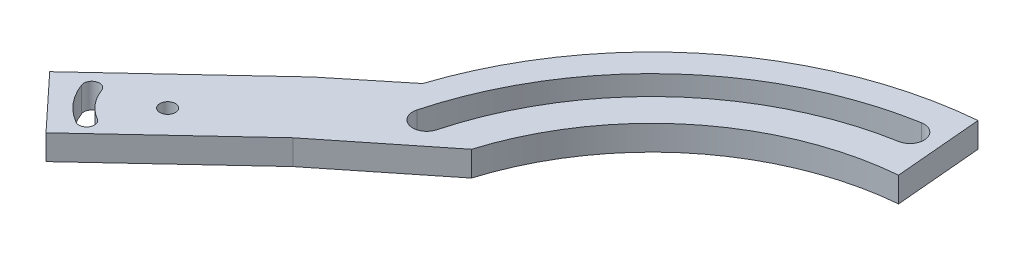
ISO-10303-21;
HEADER;
FILE_DESCRIPTION(('STEP AP214'),'2;1');
FILE_NAME('part.step','',(''),(''),'','','');
FILE_SCHEMA(('AUTOMOTIVE_DESIGN { 1 0 10303 214 1 1 1 1 }'));
ENDSEC;
DATA;
#1=APPLICATION_CONTEXT('core data for automotive mechanical design processes');
#2=APPLICATION_PROTOCOL_DEFINITION('international standard','automotive_design',2000,#1);
#3=PRODUCT_CONTEXT('',#1,'mechanical');
#4=PRODUCT('Part','Part','',(#3));
#5=PRODUCT_RELATED_PRODUCT_CATEGORY('part','',(#4));
#6=PRODUCT_DEFINITION_FORMATION('','',#4);
#7=PRODUCT_DEFINITION_CONTEXT('part definition',#1,'design');
#8=PRODUCT_DEFINITION('design','',#6,#7);
#9=PRODUCT_DEFINITION_SHAPE('','',#8);
#10=(LENGTH_UNIT() NAMED_UNIT(*) SI_UNIT(.MILLI.,.METRE.));
#11=(NAMED_UNIT(*) PLANE_ANGLE_UNIT() SI_UNIT($,.RADIAN.));
#12=(NAMED_UNIT(*) SI_UNIT($,.STERADIAN.) SOLID_ANGLE_UNIT());
#13=UNCERTAINTY_MEASURE_WITH_UNIT(LENGTH_MEASURE(1.E-05),#10,'distance_accuracy_value','');
#14=(GEOMETRIC_REPRESENTATION_CONTEXT(3) GLOBAL_UNCERTAINTY_ASSIGNED_CONTEXT((#13)) GLOBAL_UNIT_ASSIGNED_CONTEXT((#10,
#11,#12)) REPRESENTATION_CONTEXT('',''));
#15=CARTESIAN_POINT('',(0.,0.,0.));
#16=DIRECTION('',(0.,0.,1.));
#17=DIRECTION('',(1.,0.,0.));
#18=AXIS2_PLACEMENT_3D('',#15,#16,#17);
#19=CARTESIAN_POINT('',(0.,4.,0.));
#20=DIRECTION('',(0.,1.,0.));
#21=DIRECTION('',(0.,0.,1.));
#22=AXIS2_PLACEMENT_3D('',#19,#20,#21);
#23=PLANE('',#22);
#24=CARTESIAN_POINT('',(-71.6633863801421,4.,5.91316299030861));
#25=DIRECTION('',(0.,1.,0.));
#26=DIRECTION('',(0.,0.,1.));
#27=AXIS2_PLACEMENT_3D('',#24,#25,#26);
#28=CIRCLE('',#27,1.25);
#29=CARTESIAN_POINT('',(-71.6633863801421,4.,7.16316299030861));
#30=VERTEX_POINT('',#29);
#31=EDGE_CURVE('E179',#30,#30,#28,.T.);
#32=ORIENTED_EDGE('',*,*,#31,.F.);
#33=EDGE_LOOP('',(#32));
#34=FACE_BOUND('',#33,.T.);
#35=CARTESIAN_POINT('',(0.,4.,0.));
#36=DIRECTION('',(0.,1.,0.));
#37=DIRECTION('',(0.,0.,-1.));
#38=AXIS2_PLACEMENT_3D('',#35,#36,#37);
#39=CIRCLE('',#38,53.25);
#40=CARTESIAN_POINT('',(-9.24676546076391,4.,-52.4410128479001));
#41=VERTEX_POINT('',#40);
#42=CARTESIAN_POINT('',(-51.4355502498929,4.,-13.7821141517093));
#43=VERTEX_POINT('',#42);
#44=EDGE_CURVE('E214',#41,#43,#39,.T.);
#45=ORIENTED_EDGE('',*,*,#44,.F.);
#46=CARTESIAN_POINT('',(-8.8560570610133,4.,-50.2251954036226));
#47=DIRECTION('',(0.,1.,0.));
#48=DIRECTION('',(0.,0.,-1.));
#49=AXIS2_PLACEMENT_3D('',#46,#47,#48);
#50=CIRCLE('',#49,2.25);
#51=CARTESIAN_POINT('',(-8.46534866126273,4.,-48.0093779593452));
#52=VERTEX_POINT('',#51);
#53=EDGE_CURVE('E212',#52,#41,#50,.T.);
#54=ORIENTED_EDGE('',*,*,#53,.F.);
#55=CARTESIAN_POINT('',(0.,4.,0.));
#56=DIRECTION('',(0.,-1.,0.));
#57=DIRECTION('',(0.,0.,-1.));
#58=AXIS2_PLACEMENT_3D('',#55,#56,#57);
#59=CIRCLE('',#58,48.75);
#60=CARTESIAN_POINT('',(-47.0888840315921,4.,-12.6174284487479));
#61=VERTEX_POINT('',#60);
#62=EDGE_CURVE('E220',#61,#52,#59,.T.);
#63=ORIENTED_EDGE('',*,*,#62,.F.);
#64=CARTESIAN_POINT('',(-49.2622171407425,4.,-13.1997713002286));
#65=DIRECTION('',(0.,1.,0.));
#66=DIRECTION('',(0.,0.,1.));
#67=AXIS2_PLACEMENT_3D('',#64,#65,#66);
#68=CIRCLE('',#67,2.25);
#69=EDGE_CURVE('E217',#43,#61,#68,.T.);
#70=ORIENTED_EDGE('',*,*,#69,.F.);
#71=EDGE_LOOP('',(#45,#54,#63,#70));
#72=FACE_BOUND('',#71,.T.);
#73=DIRECTION('',(0.731353701619165,0.,-0.681998360062505));
#74=VECTOR('',#73,1.);
#75=CARTESIAN_POINT('',(-77.9779036453366,4.,19.0959540817501));
#76=LINE('',#75,#74);
#77=CARTESIAN_POINT('',(-77.9779036453366,4.,19.0959540817501));
#78=VERTEX_POINT('',#77);
#79=CARTESIAN_POINT('',(-57.5,4.,0.));
#80=VERTEX_POINT('',#79);
#81=EDGE_CURVE('E250',#78,#80,#76,.T.);
#82=ORIENTED_EDGE('',*,*,#81,.T.);
#83=DIRECTION('',(-0.781204335755662,0.,0.624275408611099));
#84=VECTOR('',#83,1.);
#85=CARTESIAN_POINT('',(-57.5,4.,0.));
#86=LINE('',#85,#84);
#87=CARTESIAN_POINT('',(-41.6039375852805,4.,-12.7028491843398));
#88=VERTEX_POINT('',#87);
#89=EDGE_CURVE('E188',#88,#80,#86,.T.);
#90=ORIENTED_EDGE('',*,*,#89,.F.);
#91=CARTESIAN_POINT('',(0.,4.,0.));
#92=DIRECTION('',(0.,1.,0.));
#93=DIRECTION('',(0.,0.,1.));
#94=AXIS2_PLACEMENT_3D('',#91,#92,#93);
#95=CIRCLE('',#94,43.5);
#96=CARTESIAN_POINT('',(-3.791274809523,4.,-43.3344693669909));
#97=VERTEX_POINT('',#96);
#98=EDGE_CURVE('E194',#97,#88,#95,.T.);
#99=ORIENTED_EDGE('',*,*,#98,.F.);
#100=DIRECTION('',(0.0871557427476552,0.,0.996194698091746));
#101=VECTOR('',#100,1.);
#102=CARTESIAN_POINT('',(0.,4.,0.));
#103=LINE('',#102,#101);
#104=CARTESIAN_POINT('',(-5.01145520799013,4.,-57.2811951402754));
#105=VERTEX_POINT('',#104);
#106=EDGE_CURVE('E203',#105,#97,#103,.T.);
#107=ORIENTED_EDGE('',*,*,#106,.F.);
#108=CARTESIAN_POINT('',(0.,4.,0.));
#109=DIRECTION('',(0.,1.,0.));
#110=DIRECTION('',(0.,0.,1.));
#111=AXIS2_PLACEMENT_3D('',#108,#109,#110);
#112=CIRCLE('',#111,57.5);
#113=CARTESIAN_POINT('',(-54.6394911957741,4.,-17.9102205979413));
#114=VERTEX_POINT('',#113);
#115=EDGE_CURVE('E11',#105,#114,#112,.T.);
#116=ORIENTED_EDGE('',*,*,#115,.T.);
#117=DIRECTION('',(-0.776120060457942,0.,0.630585166139166));
#118=VECTOR('',#117,1.);
#119=CARTESIAN_POINT('',(-64.3467847285699,4.,-10.0231994822548));
#120=LINE('',#119,#118);
#121=CARTESIAN_POINT('',(-64.3467847285699,4.,-10.0231994822548));
#122=VERTEX_POINT('',#121);
#123=EDGE_CURVE('E243',#114,#122,#120,.T.);
#124=ORIENTED_EDGE('',*,*,#123,.T.);
#125=DIRECTION('',(-0.731353701619164,0.,0.681998360062505));
#126=VECTOR('',#125,1.);
#127=CARTESIAN_POINT('',(-86.1618839660867,4.,10.3197096623202));
#128=LINE('',#127,#126);
#129=CARTESIAN_POINT('',(-86.1618839660867,4.,10.3197096623202));
#130=VERTEX_POINT('',#129);
#131=EDGE_CURVE('E245',#122,#130,#128,.T.);
#132=ORIENTED_EDGE('',*,*,#131,.T.);
#133=DIRECTION('',(0.681998360062505,0.,0.731353701619164));
#134=VECTOR('',#133,1.);
#135=CARTESIAN_POINT('',(-77.9779036453366,4.,19.0959540817501));
#136=LINE('',#135,#134);
#137=EDGE_CURVE('E248',#130,#78,#136,.T.);
#138=ORIENTED_EDGE('',*,*,#137,.T.);
#139=EDGE_LOOP('',(#82,#90,#99,#107,#116,#124,#132,#138));
#140=FACE_BOUND('',#139,.T.);
#141=CARTESIAN_POINT('',(-76.4133863801421,4.,14.1404043262608));
#142=DIRECTION('',(0.,1.,0.));
#143=DIRECTION('',(0.,0.,1.));
#144=AXIS2_PLACEMENT_3D('',#141,#142,#143);
#145=CIRCLE('',#144,1.25);
#146=CARTESIAN_POINT('',(-77.0383863801422,4.,15.2229360809913));
#147=VERTEX_POINT('',#146);
#148=CARTESIAN_POINT('',(-75.7883863801421,4.,13.0578725715302));
#149=VERTEX_POINT('',#148);
#150=EDGE_CURVE('E152',#147,#149,#145,.T.);
#151=ORIENTED_EDGE('',*,*,#150,.F.);
#152=CARTESIAN_POINT('',(-71.6633863801421,4.,5.91316299030861));
#153=DIRECTION('',(0.,1.,0.));
#154=DIRECTION('',(0.,0.,-1.));
#155=AXIS2_PLACEMENT_3D('',#152,#153,#154);
#156=CIRCLE('',#155,10.75);
#157=CARTESIAN_POINT('',(-81.7650820535906,4.,9.58987953105964));
#158=VERTEX_POINT('',#157);
#159=EDGE_CURVE('E165',#158,#147,#156,.T.);
#160=ORIENTED_EDGE('',*,*,#159,.F.);
#161=CARTESIAN_POINT('',(-80.5904662776083,4.,9.16235435190254));
#162=DIRECTION('',(0.,1.,0.));
#163=DIRECTION('',(0.,0.,1.));
#164=AXIS2_PLACEMENT_3D('',#161,#162,#163);
#165=CIRCLE('',#164,1.25);
#166=CARTESIAN_POINT('',(-79.4158505016259,4.,8.73482917274544));
#167=VERTEX_POINT('',#166);
#168=EDGE_CURVE('E167',#167,#158,#165,.T.);
#169=ORIENTED_EDGE('',*,*,#168,.F.);
#170=CARTESIAN_POINT('',(-71.6633863801421,4.,5.91316299030861));
#171=DIRECTION('',(0.,-1.,0.));
#172=DIRECTION('',(0.,0.,-1.));
#173=AXIS2_PLACEMENT_3D('',#170,#171,#172);
#174=CIRCLE('',#173,8.25);
#175=EDGE_CURVE('E173',#149,#167,#174,.T.);
#176=ORIENTED_EDGE('',*,*,#175,.F.);
#177=EDGE_LOOP('',(#151,#160,#169,#176));
#178=FACE_BOUND('',#177,.T.);
#179=ADVANCED_FACE('F32',(#34,#72,#140,#178),#23,.T.);
#180=CARTESIAN_POINT('',(0.,0.,0.));
#181=DIRECTION('',(0.,1.,0.));
#182=DIRECTION('',(0.,0.,1.));
#183=AXIS2_PLACEMENT_3D('',#180,#181,#182);
#184=PLANE('',#183);
#185=CARTESIAN_POINT('',(-71.6633863801421,0.,5.91316299030861));
#186=DIRECTION('',(0.,1.,0.));
#187=DIRECTION('',(0.,0.,1.));
#188=AXIS2_PLACEMENT_3D('',#185,#186,#187);
#189=CIRCLE('',#188,1.25);
#190=CARTESIAN_POINT('',(-71.6633863801421,0.,7.16316299030861));
#191=VERTEX_POINT('',#190);
#192=EDGE_CURVE('E183',#191,#191,#189,.T.);
#193=ORIENTED_EDGE('',*,*,#192,.T.);
#194=EDGE_LOOP('',(#193));
#195=FACE_BOUND('',#194,.T.);
#196=CARTESIAN_POINT('',(-8.8560570610133,0.,-50.2251954036226));
#197=DIRECTION('',(0.,1.,0.));
#198=DIRECTION('',(0.,0.,-1.));
#199=AXIS2_PLACEMENT_3D('',#196,#197,#198);
#200=CIRCLE('',#199,2.25);
#201=CARTESIAN_POINT('',(-8.46534866126273,0.,-48.0093779593452));
#202=VERTEX_POINT('',#201);
#203=CARTESIAN_POINT('',(-9.24676546076391,0.,-52.4410128479001));
#204=VERTEX_POINT('',#203);
#205=EDGE_CURVE('E211',#202,#204,#200,.T.);
#206=ORIENTED_EDGE('',*,*,#205,.T.);
#207=CARTESIAN_POINT('',(0.,0.,0.));
#208=DIRECTION('',(0.,1.,0.));
#209=DIRECTION('',(0.,0.,-1.));
#210=AXIS2_PLACEMENT_3D('',#207,#208,#209);
#211=CIRCLE('',#210,53.25);
#212=CARTESIAN_POINT('',(-51.4355502498929,0.,-13.7821141517093));
#213=VERTEX_POINT('',#212);
#214=EDGE_CURVE('E225',#204,#213,#211,.T.);
#215=ORIENTED_EDGE('',*,*,#214,.T.);
#216=CARTESIAN_POINT('',(-49.2622171407425,0.,-13.1997713002286));
#217=DIRECTION('',(0.,1.,0.));
#218=DIRECTION('',(0.,0.,1.));
#219=AXIS2_PLACEMENT_3D('',#216,#217,#218);
#220=CIRCLE('',#219,2.25);
#221=CARTESIAN_POINT('',(-47.0888840315921,0.,-12.6174284487479));
#222=VERTEX_POINT('',#221);
#223=EDGE_CURVE('E228',#213,#222,#220,.T.);
#224=ORIENTED_EDGE('',*,*,#223,.T.);
#225=CARTESIAN_POINT('',(0.,0.,0.));
#226=DIRECTION('',(0.,-1.,0.));
#227=DIRECTION('',(0.,0.,-1.));
#228=AXIS2_PLACEMENT_3D('',#225,#226,#227);
#229=CIRCLE('',#228,48.75);
#230=EDGE_CURVE('E215',#222,#202,#229,.T.);
#231=ORIENTED_EDGE('',*,*,#230,.T.);
#232=EDGE_LOOP('',(#206,#215,#224,#231));
#233=FACE_BOUND('',#232,.T.);
#234=DIRECTION('',(-0.781204335755662,0.,0.624275408611099));
#235=VECTOR('',#234,1.);
#236=CARTESIAN_POINT('',(-57.5,0.,0.));
#237=LINE('',#236,#235);
#238=CARTESIAN_POINT('',(-41.6039375852805,0.,-12.7028491843398));
#239=VERTEX_POINT('',#238);
#240=CARTESIAN_POINT('',(-57.5,0.,0.));
#241=VERTEX_POINT('',#240);
#242=EDGE_CURVE('E55',#239,#241,#237,.T.);
#243=ORIENTED_EDGE('',*,*,#242,.T.);
#244=DIRECTION('',(0.731353701619165,0.,-0.681998360062505));
#245=VECTOR('',#244,1.);
#246=CARTESIAN_POINT('',(-77.9779036453366,0.,19.0959540817501));
#247=LINE('',#246,#245);
#248=CARTESIAN_POINT('',(-77.9779036453366,0.,19.0959540817501));
#249=VERTEX_POINT('',#248);
#250=EDGE_CURVE('E246',#249,#241,#247,.T.);
#251=ORIENTED_EDGE('',*,*,#250,.F.);
#252=DIRECTION('',(0.681998360062505,0.,0.731353701619164));
#253=VECTOR('',#252,1.);
#254=CARTESIAN_POINT('',(-77.9779036453366,0.,19.0959540817501));
#255=LINE('',#254,#253);
#256=CARTESIAN_POINT('',(-86.1618839660867,0.,10.3197096623202));
#257=VERTEX_POINT('',#256);
#258=EDGE_CURVE('E257',#257,#249,#255,.T.);
#259=ORIENTED_EDGE('',*,*,#258,.F.);
#260=DIRECTION('',(-0.731353701619164,0.,0.681998360062505));
#261=VECTOR('',#260,1.);
#262=CARTESIAN_POINT('',(-86.1618839660867,0.,10.3197096623202));
#263=LINE('',#262,#261);
#264=CARTESIAN_POINT('',(-64.3467847285699,0.,-10.0231994822548));
#265=VERTEX_POINT('',#264);
#266=EDGE_CURVE('E255',#265,#257,#263,.T.);
#267=ORIENTED_EDGE('',*,*,#266,.F.);
#268=DIRECTION('',(-0.776120060457942,0.,0.630585166139166));
#269=VECTOR('',#268,1.);
#270=CARTESIAN_POINT('',(-64.3467847285699,0.,-10.0231994822548));
#271=LINE('',#270,#269);
#272=CARTESIAN_POINT('',(-54.6394911957741,0.,-17.9102205979413));
#273=VERTEX_POINT('',#272);
#274=EDGE_CURVE('E242',#273,#265,#271,.T.);
#275=ORIENTED_EDGE('',*,*,#274,.F.);
#276=CARTESIAN_POINT('',(0.,0.,0.));
#277=DIRECTION('',(0.,1.,0.));
#278=DIRECTION('',(0.,0.,1.));
#279=AXIS2_PLACEMENT_3D('',#276,#277,#278);
#280=CIRCLE('',#279,57.5);
#281=CARTESIAN_POINT('',(-5.01145520799013,0.,-57.2811951402754));
#282=VERTEX_POINT('',#281);
#283=EDGE_CURVE('E36',#282,#273,#280,.T.);
#284=ORIENTED_EDGE('',*,*,#283,.F.);
#285=DIRECTION('',(0.0871557427476552,0.,0.996194698091746));
#286=VECTOR('',#285,1.);
#287=CARTESIAN_POINT('',(0.,0.,0.));
#288=LINE('',#287,#286);
#289=CARTESIAN_POINT('',(-3.791274809523,0.,-43.3344693669909));
#290=VERTEX_POINT('',#289);
#291=EDGE_CURVE('E202',#282,#290,#288,.T.);
#292=ORIENTED_EDGE('',*,*,#291,.T.);
#293=CARTESIAN_POINT('',(0.,0.,0.));
#294=DIRECTION('',(0.,1.,0.));
#295=DIRECTION('',(0.,0.,1.));
#296=AXIS2_PLACEMENT_3D('',#293,#294,#295);
#297=CIRCLE('',#296,43.5);
#298=EDGE_CURVE('E193',#290,#239,#297,.T.);
#299=ORIENTED_EDGE('',*,*,#298,.T.);
#300=EDGE_LOOP('',(#243,#251,#259,#267,#275,#284,#292,#299));
#301=FACE_BOUND('',#300,.T.);
#302=CARTESIAN_POINT('',(-71.6633863801421,0.,5.91316299030861));
#303=DIRECTION('',(0.,1.,0.));
#304=DIRECTION('',(0.,0.,-1.));
#305=AXIS2_PLACEMENT_3D('',#302,#303,#304);
#306=CIRCLE('',#305,10.75);
#307=CARTESIAN_POINT('',(-81.7650820535906,0.,9.58987953105964));
#308=VERTEX_POINT('',#307);
#309=CARTESIAN_POINT('',(-77.0383863801422,0.,15.2229360809913));
#310=VERTEX_POINT('',#309);
#311=EDGE_CURVE('E155',#308,#310,#306,.T.);
#312=ORIENTED_EDGE('',*,*,#311,.T.);
#313=CARTESIAN_POINT('',(-76.4133863801421,0.,14.1404043262608));
#314=DIRECTION('',(0.,1.,0.));
#315=DIRECTION('',(0.,0.,1.));
#316=AXIS2_PLACEMENT_3D('',#313,#314,#315);
#317=CIRCLE('',#316,1.25);
#318=CARTESIAN_POINT('',(-75.7883863801421,0.,13.0578725715302));
#319=VERTEX_POINT('',#318);
#320=EDGE_CURVE('E150',#310,#319,#317,.T.);
#321=ORIENTED_EDGE('',*,*,#320,.T.);
#322=CARTESIAN_POINT('',(-71.6633863801421,0.,5.91316299030861));
#323=DIRECTION('',(0.,-1.,0.));
#324=DIRECTION('',(0.,0.,-1.));
#325=AXIS2_PLACEMENT_3D('',#322,#323,#324);
#326=CIRCLE('',#325,8.25);
#327=CARTESIAN_POINT('',(-79.4158505016259,0.,8.73482917274544));
#328=VERTEX_POINT('',#327);
#329=EDGE_CURVE('E47',#319,#328,#326,.T.);
#330=ORIENTED_EDGE('',*,*,#329,.T.);
#331=CARTESIAN_POINT('',(-80.5904662776083,0.,9.16235435190254));
#332=DIRECTION('',(0.,1.,0.));
#333=DIRECTION('',(0.,0.,1.));
#334=AXIS2_PLACEMENT_3D('',#331,#332,#333);
#335=CIRCLE('',#334,1.25);
#336=EDGE_CURVE('E160',#328,#308,#335,.T.);
#337=ORIENTED_EDGE('',*,*,#336,.T.);
#338=EDGE_LOOP('',(#312,#321,#330,#337));
#339=FACE_BOUND('',#338,.T.);
#340=ADVANCED_FACE('F162',(#195,#233,#301,#339),#184,.F.);
#341=CARTESIAN_POINT('',(0.,4.,0.));
#342=DIRECTION('',(0.,-1.,0.));
#343=DIRECTION('',(0.,0.,-1.));
#344=AXIS2_PLACEMENT_3D('',#341,#342,#343);
#345=CYLINDRICAL_SURFACE('',#344,43.5);
#346=ORIENTED_EDGE('',*,*,#98,.T.);
#347=DIRECTION('',(0.,-1.,0.));
#348=VECTOR('',#347,1.);
#349=CARTESIAN_POINT('',(-41.6039375852805,4.,-12.7028491843398));
#350=LINE('',#349,#348);
#351=EDGE_CURVE('E190',#88,#239,#350,.T.);
#352=ORIENTED_EDGE('',*,*,#351,.T.);
#353=ORIENTED_EDGE('',*,*,#298,.F.);
#354=DIRECTION('',(0.,-1.,0.));
#355=VECTOR('',#354,1.);
#356=CARTESIAN_POINT('',(-3.791274809523,4.,-43.3344693669909));
#357=LINE('',#356,#355);
#358=EDGE_CURVE('E197',#97,#290,#357,.T.);
#359=ORIENTED_EDGE('',*,*,#358,.F.);
#360=EDGE_LOOP('',(#346,#352,#353,#359));
#361=FACE_BOUND('',#360,.T.);
#362=ADVANCED_FACE('F299',(#361),#345,.F.);
#363=CARTESIAN_POINT('',(0.,4.,0.));
#364=DIRECTION('',(0.996194698091746,0.,-0.0871557427476552));
#365=DIRECTION('',(-0.0871557427476552,0.,-0.996194698091746));
#366=AXIS2_PLACEMENT_3D('',#363,#364,#365);
#367=PLANE('',#366);
#368=ORIENTED_EDGE('',*,*,#106,.T.);
#369=ORIENTED_EDGE('',*,*,#358,.T.);
#370=ORIENTED_EDGE('',*,*,#291,.F.);
#371=DIRECTION('',(0.,-1.,0.));
#372=VECTOR('',#371,1.);
#373=CARTESIAN_POINT('',(-5.01145520799013,4.,-57.2811951402754));
#374=LINE('',#373,#372);
#375=EDGE_CURVE('E206',#105,#282,#374,.T.);
#376=ORIENTED_EDGE('',*,*,#375,.F.);
#377=EDGE_LOOP('',(#368,#369,#370,#376));
#378=FACE_BOUND('',#377,.T.);
#379=ADVANCED_FACE('F297',(#378),#367,.T.);
#380=CARTESIAN_POINT('',(0.,4.,0.));
#381=DIRECTION('',(0.,-1.,0.));
#382=DIRECTION('',(0.,0.,-1.));
#383=AXIS2_PLACEMENT_3D('',#380,#381,#382);
#384=CYLINDRICAL_SURFACE('',#383,57.5);
#385=ORIENTED_EDGE('',*,*,#375,.T.);
#386=ORIENTED_EDGE('',*,*,#283,.T.);
#387=DIRECTION('',(0.,-1.,0.));
#388=VECTOR('',#387,1.);
#389=CARTESIAN_POINT('',(-54.6394911957741,4.,-17.9102205979413));
#390=LINE('',#389,#388);
#391=EDGE_CURVE('E271',#114,#273,#390,.T.);
#392=ORIENTED_EDGE('',*,*,#391,.F.);
#393=ORIENTED_EDGE('',*,*,#115,.F.);
#394=EDGE_LOOP('',(#385,#386,#392,#393));
#395=FACE_BOUND('',#394,.T.);
#396=ADVANCED_FACE('F34',(#395),#384,.T.);
#397=CARTESIAN_POINT('',(-64.3467847285699,4.,-10.0231994822548));
#398=DIRECTION('',(0.630585166139166,0.,0.776120060457943));
#399=DIRECTION('',(0.776120060457943,0.,-0.630585166139166));
#400=AXIS2_PLACEMENT_3D('',#397,#398,#399);
#401=PLANE('',#400);
#402=ORIENTED_EDGE('',*,*,#123,.F.);
#403=ORIENTED_EDGE('',*,*,#391,.T.);
#404=ORIENTED_EDGE('',*,*,#274,.T.);
#405=DIRECTION('',(0.,-1.,0.));
#406=VECTOR('',#405,1.);
#407=CARTESIAN_POINT('',(-64.3467847285699,4.,-10.0231994822548));
#408=LINE('',#407,#406);
#409=EDGE_CURVE('E268',#122,#265,#408,.T.);
#410=ORIENTED_EDGE('',*,*,#409,.F.);
#411=EDGE_LOOP('',(#402,#403,#404,#410));
#412=FACE_BOUND('',#411,.T.);
#413=ADVANCED_FACE('F284',(#412),#401,.F.);
#414=CARTESIAN_POINT('',(-86.1618839660867,4.,10.3197096623202));
#415=DIRECTION('',(0.681998360062505,0.,0.731353701619164));
#416=DIRECTION('',(0.731353701619164,0.,-0.681998360062505));
#417=AXIS2_PLACEMENT_3D('',#414,#415,#416);
#418=PLANE('',#417);
#419=ORIENTED_EDGE('',*,*,#266,.T.);
#420=DIRECTION('',(0.,-1.,0.));
#421=VECTOR('',#420,1.);
#422=CARTESIAN_POINT('',(-86.1618839660867,4.,10.3197096623202));
#423=LINE('',#422,#421);
#424=EDGE_CURVE('E265',#130,#257,#423,.T.);
#425=ORIENTED_EDGE('',*,*,#424,.F.);
#426=ORIENTED_EDGE('',*,*,#131,.F.);
#427=ORIENTED_EDGE('',*,*,#409,.T.);
#428=EDGE_LOOP('',(#419,#425,#426,#427));
#429=FACE_BOUND('',#428,.T.);
#430=ADVANCED_FACE('F287',(#429),#418,.F.);
#431=CARTESIAN_POINT('',(-77.9779036453366,4.,19.0959540817501));
#432=DIRECTION('',(0.731353701619164,0.,-0.681998360062505));
#433=DIRECTION('',(-0.681998360062505,0.,-0.731353701619164));
#434=AXIS2_PLACEMENT_3D('',#431,#432,#433);
#435=PLANE('',#434);
#436=ORIENTED_EDGE('',*,*,#258,.T.);
#437=DIRECTION('',(0.,-1.,0.));
#438=VECTOR('',#437,1.);
#439=CARTESIAN_POINT('',(-77.9779036453366,4.,19.0959540817501));
#440=LINE('',#439,#438);
#441=EDGE_CURVE('E262',#78,#249,#440,.T.);
#442=ORIENTED_EDGE('',*,*,#441,.F.);
#443=ORIENTED_EDGE('',*,*,#137,.F.);
#444=ORIENTED_EDGE('',*,*,#424,.T.);
#445=EDGE_LOOP('',(#436,#442,#443,#444));
#446=FACE_BOUND('',#445,.T.);
#447=ADVANCED_FACE('F306',(#446),#435,.F.);
#448=CARTESIAN_POINT('',(-77.9779036453366,4.,19.0959540817501));
#449=DIRECTION('',(-0.681998360062505,0.,-0.731353701619165));
#450=DIRECTION('',(-0.731353701619165,0.,0.681998360062505));
#451=AXIS2_PLACEMENT_3D('',#448,#449,#450);
#452=PLANE('',#451);
#453=ORIENTED_EDGE('',*,*,#250,.T.);
#454=DIRECTION('',(0.,-1.,0.));
#455=VECTOR('',#454,1.);
#456=CARTESIAN_POINT('',(-57.5,4.,0.));
#457=LINE('',#456,#455);
#458=EDGE_CURVE('E253',#80,#241,#457,.T.);
#459=ORIENTED_EDGE('',*,*,#458,.F.);
#460=ORIENTED_EDGE('',*,*,#81,.F.);
#461=ORIENTED_EDGE('',*,*,#441,.T.);
#462=EDGE_LOOP('',(#453,#459,#460,#461));
#463=FACE_BOUND('',#462,.T.);
#464=ADVANCED_FACE('F303',(#463),#452,.F.);
#465=CARTESIAN_POINT('',(-8.8560570610133,4.,-50.2251954036226));
#466=DIRECTION('',(0.,-1.,0.));
#467=DIRECTION('',(0.,0.,-1.));
#468=AXIS2_PLACEMENT_3D('',#465,#466,#467);
#469=CYLINDRICAL_SURFACE('',#468,2.25);
#470=ORIENTED_EDGE('',*,*,#205,.F.);
#471=DIRECTION('',(0.,-1.,0.));
#472=VECTOR('',#471,1.);
#473=CARTESIAN_POINT('',(-8.46534866126273,4.,-48.0093779593452));
#474=LINE('',#473,#472);
#475=EDGE_CURVE('E222',#52,#202,#474,.T.);
#476=ORIENTED_EDGE('',*,*,#475,.F.);
#477=ORIENTED_EDGE('',*,*,#53,.T.);
#478=DIRECTION('',(0.,-1.,0.));
#479=VECTOR('',#478,1.);
#480=CARTESIAN_POINT('',(-9.24676546076391,4.,-52.4410128479001));
#481=LINE('',#480,#479);
#482=EDGE_CURVE('E239',#41,#204,#481,.T.);
#483=ORIENTED_EDGE('',*,*,#482,.T.);
#484=EDGE_LOOP('',(#470,#476,#477,#483));
#485=FACE_BOUND('',#484,.T.);
#486=ADVANCED_FACE('F313',(#485),#469,.F.);
#487=CARTESIAN_POINT('',(0.,4.,0.));
#488=DIRECTION('',(0.,-1.,0.));
#489=DIRECTION('',(0.,0.,-1.));
#490=AXIS2_PLACEMENT_3D('',#487,#488,#489);
#491=CYLINDRICAL_SURFACE('',#490,53.25);
#492=ORIENTED_EDGE('',*,*,#214,.F.);
#493=ORIENTED_EDGE('',*,*,#482,.F.);
#494=ORIENTED_EDGE('',*,*,#44,.T.);
#495=DIRECTION('',(0.,-1.,0.));
#496=VECTOR('',#495,1.);
#497=CARTESIAN_POINT('',(-51.4355502498929,4.,-13.7821141517093));
#498=LINE('',#497,#496);
#499=EDGE_CURVE('E237',#43,#213,#498,.T.);
#500=ORIENTED_EDGE('',*,*,#499,.T.);
#501=EDGE_LOOP('',(#492,#493,#494,#500));
#502=FACE_BOUND('',#501,.T.);
#503=ADVANCED_FACE('F348',(#502),#491,.F.);
#504=CARTESIAN_POINT('',(-49.2622171407425,4.,-13.1997713002286));
#505=DIRECTION('',(0.,-1.,0.));
#506=DIRECTION('',(0.,0.,-1.));
#507=AXIS2_PLACEMENT_3D('',#504,#505,#506);
#508=CYLINDRICAL_SURFACE('',#507,2.25);
#509=ORIENTED_EDGE('',*,*,#223,.F.);
#510=ORIENTED_EDGE('',*,*,#499,.F.);
#511=ORIENTED_EDGE('',*,*,#69,.T.);
#512=DIRECTION('',(0.,-1.,0.));
#513=VECTOR('',#512,1.);
#514=CARTESIAN_POINT('',(-47.0888840315921,4.,-12.6174284487479));
#515=LINE('',#514,#513);
#516=EDGE_CURVE('E235',#61,#222,#515,.T.);
#517=ORIENTED_EDGE('',*,*,#516,.T.);
#518=EDGE_LOOP('',(#509,#510,#511,#517));
#519=FACE_BOUND('',#518,.T.);
#520=ADVANCED_FACE('F344',(#519),#508,.F.);
#521=CARTESIAN_POINT('',(0.,4.,0.));
#522=DIRECTION('',(0.,-1.,0.));
#523=DIRECTION('',(0.,0.,-1.));
#524=AXIS2_PLACEMENT_3D('',#521,#522,#523);
#525=CYLINDRICAL_SURFACE('',#524,48.75);
#526=ORIENTED_EDGE('',*,*,#230,.F.);
#527=ORIENTED_EDGE('',*,*,#516,.F.);
#528=ORIENTED_EDGE('',*,*,#62,.T.);
#529=ORIENTED_EDGE('',*,*,#475,.T.);
#530=EDGE_LOOP('',(#526,#527,#528,#529));
#531=FACE_BOUND('',#530,.T.);
#532=ADVANCED_FACE('F340',(#531),#525,.T.);
#533=CARTESIAN_POINT('',(-57.5,4.,0.));
#534=DIRECTION('',(0.624275408611099,0.,0.781204335755662));
#535=DIRECTION('',(0.781204335755662,0.,-0.624275408611099));
#536=AXIS2_PLACEMENT_3D('',#533,#534,#535);
#537=PLANE('',#536);
#538=ORIENTED_EDGE('',*,*,#242,.F.);
#539=ORIENTED_EDGE('',*,*,#351,.F.);
#540=ORIENTED_EDGE('',*,*,#89,.T.);
#541=ORIENTED_EDGE('',*,*,#458,.T.);
#542=EDGE_LOOP('',(#538,#539,#540,#541));
#543=FACE_BOUND('',#542,.T.);
#544=ADVANCED_FACE('F343',(#543),#537,.T.);
#545=CARTESIAN_POINT('',(-71.6633863801421,0.,5.91316299030861));
#546=DIRECTION('',(0.,1.,0.));
#547=DIRECTION('',(0.,0.,1.));
#548=AXIS2_PLACEMENT_3D('',#545,#546,#547);
#549=CYLINDRICAL_SURFACE('',#548,1.25);
#550=ORIENTED_EDGE('',*,*,#192,.F.);
#551=EDGE_LOOP('',(#550));
#552=FACE_BOUND('',#551,.T.);
#553=ORIENTED_EDGE('',*,*,#31,.T.);
#554=EDGE_LOOP('',(#553));
#555=FACE_BOUND('',#554,.T.);
#556=ADVANCED_FACE('F387',(#552,#555),#549,.F.);
#557=CARTESIAN_POINT('',(-71.6633863801421,0.,5.91316299030861));
#558=DIRECTION('',(0.,1.,0.));
#559=DIRECTION('',(0.,0.,1.));
#560=AXIS2_PLACEMENT_3D('',#557,#558,#559);
#561=CYLINDRICAL_SURFACE('',#560,10.75);
#562=ORIENTED_EDGE('',*,*,#311,.F.);
#563=DIRECTION('',(0.,1.,0.));
#564=VECTOR('',#563,1.);
#565=CARTESIAN_POINT('',(-81.7650820535906,0.,9.58987953105964));
#566=LINE('',#565,#564);
#567=EDGE_CURVE('E180',#308,#158,#566,.T.);
#568=ORIENTED_EDGE('',*,*,#567,.T.);
#569=ORIENTED_EDGE('',*,*,#159,.T.);
#570=DIRECTION('',(0.,1.,0.));
#571=VECTOR('',#570,1.);
#572=CARTESIAN_POINT('',(-77.0383863801422,0.,15.2229360809913));
#573=LINE('',#572,#571);
#574=EDGE_CURVE('E177',#310,#147,#573,.T.);
#575=ORIENTED_EDGE('',*,*,#574,.F.);
#576=EDGE_LOOP('',(#562,#568,#569,#575));
#577=FACE_BOUND('',#576,.T.);
#578=ADVANCED_FACE('F393',(#577),#561,.F.);
#579=CARTESIAN_POINT('',(-71.6633863801421,0.,5.91316299030861));
#580=DIRECTION('',(0.,1.,0.));
#581=DIRECTION('',(0.,0.,1.));
#582=AXIS2_PLACEMENT_3D('',#579,#580,#581);
#583=CYLINDRICAL_SURFACE('',#582,8.25);
#584=ORIENTED_EDGE('',*,*,#329,.F.);
#585=DIRECTION('',(0.,1.,0.));
#586=VECTOR('',#585,1.);
#587=CARTESIAN_POINT('',(-75.7883863801421,0.,13.0578725715302));
#588=LINE('',#587,#586);
#589=EDGE_CURVE('E147',#319,#149,#588,.T.);
#590=ORIENTED_EDGE('',*,*,#589,.T.);
#591=ORIENTED_EDGE('',*,*,#175,.T.);
#592=DIRECTION('',(0.,1.,0.));
#593=VECTOR('',#592,1.);
#594=CARTESIAN_POINT('',(-79.4158505016259,0.,8.73482917274544));
#595=LINE('',#594,#593);
#596=EDGE_CURVE('E154',#328,#167,#595,.T.);
#597=ORIENTED_EDGE('',*,*,#596,.F.);
#598=EDGE_LOOP('',(#584,#590,#591,#597));
#599=FACE_BOUND('',#598,.T.);
#600=ADVANCED_FACE('F158',(#599),#583,.T.);
#601=CARTESIAN_POINT('',(-76.4133863801421,0.,14.1404043262608));
#602=DIRECTION('',(0.,1.,0.));
#603=DIRECTION('',(0.,0.,1.));
#604=AXIS2_PLACEMENT_3D('',#601,#602,#603);
#605=CYLINDRICAL_SURFACE('',#604,1.25);
#606=ORIENTED_EDGE('',*,*,#150,.T.);
#607=ORIENTED_EDGE('',*,*,#589,.F.);
#608=ORIENTED_EDGE('',*,*,#320,.F.);
#609=ORIENTED_EDGE('',*,*,#574,.T.);
#610=EDGE_LOOP('',(#606,#607,#608,#609));
#611=FACE_BOUND('',#610,.T.);
#612=ADVANCED_FACE('F148',(#611),#605,.F.);
#613=CARTESIAN_POINT('',(-80.5904662776083,0.,9.16235435190254));
#614=DIRECTION('',(0.,1.,0.));
#615=DIRECTION('',(0.,0.,1.));
#616=AXIS2_PLACEMENT_3D('',#613,#614,#615);
#617=CYLINDRICAL_SURFACE('',#616,1.25);
#618=ORIENTED_EDGE('',*,*,#168,.T.);
#619=ORIENTED_EDGE('',*,*,#567,.F.);
#620=ORIENTED_EDGE('',*,*,#336,.F.);
#621=ORIENTED_EDGE('',*,*,#596,.T.);
#622=EDGE_LOOP('',(#618,#619,#620,#621));
#623=FACE_BOUND('',#622,.T.);
#624=ADVANCED_FACE('F415',(#623),#617,.F.);
#625=CLOSED_SHELL('',(#179,#340,#362,#379,#396,#413,#430,#447,#464,#486,#503,#520,#532,#544,
#556,#578,#600,#612,#624));
#626=MANIFOLD_SOLID_BREP('B2',#625);
#627=ADVANCED_BREP_SHAPE_REPRESENTATION('',(#18,#626),#14);
#628=SHAPE_DEFINITION_REPRESENTATION(#9,#627);
ENDSEC;
END-ISO-10303-21;
